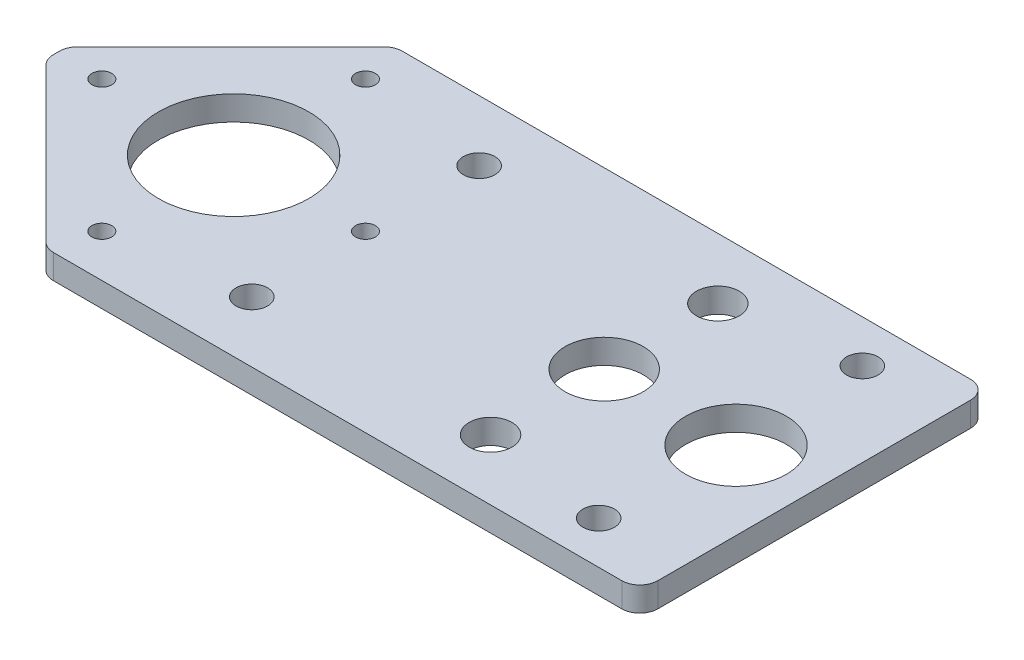
ISO-10303-21;
HEADER;
FILE_DESCRIPTION(('STEP AP214'),'2;1');
FILE_NAME('part.step','',(''),(''),'','','');
FILE_SCHEMA(('AUTOMOTIVE_DESIGN { 1 0 10303 214 1 1 1 1 }'));
ENDSEC;
DATA;
#1=APPLICATION_CONTEXT('core data for automotive mechanical design processes');
#2=APPLICATION_PROTOCOL_DEFINITION('international standard','automotive_design',2000,#1);
#3=PRODUCT_CONTEXT('',#1,'mechanical');
#4=PRODUCT('Part','Part','',(#3));
#5=PRODUCT_RELATED_PRODUCT_CATEGORY('part','',(#4));
#6=PRODUCT_DEFINITION_FORMATION('','',#4);
#7=PRODUCT_DEFINITION_CONTEXT('part definition',#1,'design');
#8=PRODUCT_DEFINITION('design','',#6,#7);
#9=PRODUCT_DEFINITION_SHAPE('','',#8);
#10=(LENGTH_UNIT() NAMED_UNIT(*) SI_UNIT(.MILLI.,.METRE.));
#11=(NAMED_UNIT(*) PLANE_ANGLE_UNIT() SI_UNIT($,.RADIAN.));
#12=(NAMED_UNIT(*) SI_UNIT($,.STERADIAN.) SOLID_ANGLE_UNIT());
#13=UNCERTAINTY_MEASURE_WITH_UNIT(LENGTH_MEASURE(1.E-05),#10,'distance_accuracy_value','');
#14=(GEOMETRIC_REPRESENTATION_CONTEXT(3) GLOBAL_UNCERTAINTY_ASSIGNED_CONTEXT((#13)) GLOBAL_UNIT_ASSIGNED_CONTEXT((#10,
#11,#12)) REPRESENTATION_CONTEXT('',''));
#15=CARTESIAN_POINT('',(0.,0.,0.));
#16=DIRECTION('',(0.,0.,1.));
#17=DIRECTION('',(1.,0.,0.));
#18=AXIS2_PLACEMENT_3D('',#15,#16,#17);
#19=CARTESIAN_POINT('',(-3.,4.064,-26.));
#20=DIRECTION('',(0.,-1.,0.));
#21=DIRECTION('',(0.,0.,-1.));
#22=AXIS2_PLACEMENT_3D('',#19,#20,#21);
#23=CYLINDRICAL_SURFACE('',#22,3.);
#24=CARTESIAN_POINT('',(-3.,0.,-26.));
#25=DIRECTION('',(0.,-1.,0.));
#26=DIRECTION('',(0.,0.,-1.));
#27=AXIS2_PLACEMENT_3D('',#24,#25,#26);
#28=CIRCLE('',#27,3.);
#29=CARTESIAN_POINT('',(-3.,0.,-29.));
#30=VERTEX_POINT('',#29);
#31=CARTESIAN_POINT('',(0.,0.,-26.));
#32=VERTEX_POINT('',#31);
#33=EDGE_CURVE('E163',#30,#32,#28,.T.);
#34=ORIENTED_EDGE('',*,*,#33,.F.);
#35=DIRECTION('',(0.,-1.,0.));
#36=VECTOR('',#35,1.);
#37=CARTESIAN_POINT('',(-3.,4.064,-29.));
#38=LINE('',#37,#36);
#39=CARTESIAN_POINT('',(-3.,4.064,-29.));
#40=VERTEX_POINT('',#39);
#41=EDGE_CURVE('E13',#40,#30,#38,.T.);
#42=ORIENTED_EDGE('',*,*,#41,.F.);
#43=CARTESIAN_POINT('',(-3.,4.064,-26.));
#44=DIRECTION('',(0.,-1.,0.));
#45=DIRECTION('',(0.,0.,-1.));
#46=AXIS2_PLACEMENT_3D('',#43,#44,#45);
#47=CIRCLE('',#46,3.);
#48=CARTESIAN_POINT('',(0.,4.064,-26.));
#49=VERTEX_POINT('',#48);
#50=EDGE_CURVE('E196',#40,#49,#47,.T.);
#51=ORIENTED_EDGE('',*,*,#50,.T.);
#52=DIRECTION('',(0.,-1.,0.));
#53=VECTOR('',#52,1.);
#54=CARTESIAN_POINT('',(0.,4.064,-26.));
#55=LINE('',#54,#53);
#56=EDGE_CURVE('E45',#49,#32,#55,.T.);
#57=ORIENTED_EDGE('',*,*,#56,.T.);
#58=EDGE_LOOP('',(#34,#42,#51,#57));
#59=FACE_BOUND('',#58,.T.);
#60=ADVANCED_FACE('F42',(#59),#23,.T.);
#61=CARTESIAN_POINT('',(-97.5,4.064,-29.));
#62=DIRECTION('',(0.,0.,-1.));
#63=DIRECTION('',(-1.,0.,0.));
#64=AXIS2_PLACEMENT_3D('',#61,#62,#63);
#65=PLANE('',#64);
#66=DIRECTION('',(1.,0.,0.));
#67=VECTOR('',#66,1.);
#68=CARTESIAN_POINT('',(-97.5,0.,-29.));
#69=LINE('',#68,#67);
#70=CARTESIAN_POINT('',(-97.5,0.,-29.));
#71=VERTEX_POINT('',#70);
#72=EDGE_CURVE('E194',#71,#30,#69,.T.);
#73=ORIENTED_EDGE('',*,*,#72,.F.);
#74=DIRECTION('',(0.,-1.,0.));
#75=VECTOR('',#74,1.);
#76=CARTESIAN_POINT('',(-97.5,4.064,-29.));
#77=LINE('',#76,#75);
#78=CARTESIAN_POINT('',(-97.5,4.064,-29.));
#79=VERTEX_POINT('',#78);
#80=EDGE_CURVE('E51',#79,#71,#77,.T.);
#81=ORIENTED_EDGE('',*,*,#80,.F.);
#82=DIRECTION('',(1.,0.,0.));
#83=VECTOR('',#82,1.);
#84=CARTESIAN_POINT('',(-97.5,4.064,-29.));
#85=LINE('',#84,#83);
#86=EDGE_CURVE('E153',#79,#40,#85,.T.);
#87=ORIENTED_EDGE('',*,*,#86,.T.);
#88=ORIENTED_EDGE('',*,*,#41,.T.);
#89=EDGE_LOOP('',(#73,#81,#87,#88));
#90=FACE_BOUND('',#89,.T.);
#91=ADVANCED_FACE('F216',(#90),#65,.T.);
#92=CARTESIAN_POINT('',(-97.5,4.064,-25.9999999999998));
#93=DIRECTION('',(0.,-1.,0.));
#94=DIRECTION('',(0.,0.,-1.));
#95=AXIS2_PLACEMENT_3D('',#92,#93,#94);
#96=CYLINDRICAL_SURFACE('',#95,3.00000000000019);
#97=CARTESIAN_POINT('',(-97.5,0.,-25.9999999999998));
#98=DIRECTION('',(0.,-1.,0.));
#99=DIRECTION('',(0.,0.,-1.));
#100=AXIS2_PLACEMENT_3D('',#97,#98,#99);
#101=CIRCLE('',#100,3.00000000000019);
#102=CARTESIAN_POINT('',(-99.6213203435598,0.,-28.1213203435596));
#103=VERTEX_POINT('',#102);
#104=EDGE_CURVE('E140',#103,#71,#101,.T.);
#105=ORIENTED_EDGE('',*,*,#104,.F.);
#106=DIRECTION('',(0.,-1.,0.));
#107=VECTOR('',#106,1.);
#108=CARTESIAN_POINT('',(-99.6213203435598,4.064,-28.1213203435596));
#109=LINE('',#108,#107);
#110=CARTESIAN_POINT('',(-99.6213203435598,4.064,-28.1213203435596));
#111=VERTEX_POINT('',#110);
#112=EDGE_CURVE('E135',#111,#103,#109,.T.);
#113=ORIENTED_EDGE('',*,*,#112,.F.);
#114=CARTESIAN_POINT('',(-97.5,4.064,-25.9999999999998));
#115=DIRECTION('',(0.,-1.,0.));
#116=DIRECTION('',(0.,0.,-1.));
#117=AXIS2_PLACEMENT_3D('',#114,#115,#116);
#118=CIRCLE('',#117,3.00000000000019);
#119=EDGE_CURVE('E138',#111,#79,#118,.T.);
#120=ORIENTED_EDGE('',*,*,#119,.T.);
#121=ORIENTED_EDGE('',*,*,#80,.T.);
#122=EDGE_LOOP('',(#105,#113,#120,#121));
#123=FACE_BOUND('',#122,.T.);
#124=ADVANCED_FACE('F137',(#123),#96,.T.);
#125=CARTESIAN_POINT('',(-125.12132034356,4.064,-2.62132034355977));
#126=DIRECTION('',(-0.707106781186547,0.,-0.707106781186548));
#127=DIRECTION('',(-0.707106781186548,0.,0.707106781186547));
#128=AXIS2_PLACEMENT_3D('',#125,#126,#127);
#129=PLANE('',#128);
#130=DIRECTION('',(0.707106781186548,0.,-0.707106781186547));
#131=VECTOR('',#130,1.);
#132=CARTESIAN_POINT('',(-125.12132034356,0.,-2.62132034355977));
#133=LINE('',#132,#131);
#134=CARTESIAN_POINT('',(-125.12132034356,0.,-2.62132034355977));
#135=VERTEX_POINT('',#134);
#136=EDGE_CURVE('E191',#135,#103,#133,.T.);
#137=ORIENTED_EDGE('',*,*,#136,.F.);
#138=DIRECTION('',(0.,-1.,0.));
#139=VECTOR('',#138,1.);
#140=CARTESIAN_POINT('',(-125.12132034356,4.064,-2.62132034355977));
#141=LINE('',#140,#139);
#142=CARTESIAN_POINT('',(-125.12132034356,4.064,-2.62132034355977));
#143=VERTEX_POINT('',#142);
#144=EDGE_CURVE('E145',#143,#135,#141,.T.);
#145=ORIENTED_EDGE('',*,*,#144,.F.);
#146=DIRECTION('',(0.707106781186548,0.,-0.707106781186547));
#147=VECTOR('',#146,1.);
#148=CARTESIAN_POINT('',(-125.12132034356,4.064,-2.62132034355977));
#149=LINE('',#148,#147);
#150=EDGE_CURVE('E151',#143,#111,#149,.T.);
#151=ORIENTED_EDGE('',*,*,#150,.T.);
#152=ORIENTED_EDGE('',*,*,#112,.T.);
#153=EDGE_LOOP('',(#137,#145,#151,#152));
#154=FACE_BOUND('',#153,.T.);
#155=ADVANCED_FACE('F155',(#154),#129,.T.);
#156=CARTESIAN_POINT('',(-123.,4.064,-0.5));
#157=DIRECTION('',(0.,-1.,0.));
#158=DIRECTION('',(0.,0.,-1.));
#159=AXIS2_PLACEMENT_3D('',#156,#157,#158);
#160=CYLINDRICAL_SURFACE('',#159,3.0000000000002);
#161=CARTESIAN_POINT('',(-123.,0.,-0.5));
#162=DIRECTION('',(0.,-1.,0.));
#163=DIRECTION('',(0.,0.,-1.));
#164=AXIS2_PLACEMENT_3D('',#161,#162,#163);
#165=CIRCLE('',#164,3.0000000000002);
#166=CARTESIAN_POINT('',(-126.,0.,-0.5));
#167=VERTEX_POINT('',#166);
#168=EDGE_CURVE('E188',#167,#135,#165,.T.);
#169=ORIENTED_EDGE('',*,*,#168,.F.);
#170=DIRECTION('',(0.,-1.,0.));
#171=VECTOR('',#170,1.);
#172=CARTESIAN_POINT('',(-126.,4.064,-0.5));
#173=LINE('',#172,#171);
#174=CARTESIAN_POINT('',(-126.,4.064,-0.5));
#175=VERTEX_POINT('',#174);
#176=EDGE_CURVE('E200',#175,#167,#173,.T.);
#177=ORIENTED_EDGE('',*,*,#176,.F.);
#178=CARTESIAN_POINT('',(-123.,4.064,-0.5));
#179=DIRECTION('',(0.,-1.,0.));
#180=DIRECTION('',(0.,0.,-1.));
#181=AXIS2_PLACEMENT_3D('',#178,#179,#180);
#182=CIRCLE('',#181,3.0000000000002);
#183=EDGE_CURVE('E156',#175,#143,#182,.T.);
#184=ORIENTED_EDGE('',*,*,#183,.T.);
#185=ORIENTED_EDGE('',*,*,#144,.T.);
#186=EDGE_LOOP('',(#169,#177,#184,#185));
#187=FACE_BOUND('',#186,.T.);
#188=ADVANCED_FACE('F229',(#187),#160,.T.);
#189=CARTESIAN_POINT('',(-126.,4.064,0.500000000000084));
#190=DIRECTION('',(-1.,0.,0.));
#191=DIRECTION('',(0.,0.,1.));
#192=AXIS2_PLACEMENT_3D('',#189,#190,#191);
#193=PLANE('',#192);
#194=DIRECTION('',(0.,0.,-1.));
#195=VECTOR('',#194,1.);
#196=CARTESIAN_POINT('',(-126.,0.,0.500000000000084));
#197=LINE('',#196,#195);
#198=CARTESIAN_POINT('',(-126.,0.,0.500000000000084));
#199=VERTEX_POINT('',#198);
#200=EDGE_CURVE('E185',#199,#167,#197,.T.);
#201=ORIENTED_EDGE('',*,*,#200,.F.);
#202=DIRECTION('',(0.,-1.,0.));
#203=VECTOR('',#202,1.);
#204=CARTESIAN_POINT('',(-126.,4.064,0.500000000000084));
#205=LINE('',#204,#203);
#206=CARTESIAN_POINT('',(-126.,4.064,0.500000000000084));
#207=VERTEX_POINT('',#206);
#208=EDGE_CURVE('E202',#207,#199,#205,.T.);
#209=ORIENTED_EDGE('',*,*,#208,.F.);
#210=DIRECTION('',(0.,0.,-1.));
#211=VECTOR('',#210,1.);
#212=CARTESIAN_POINT('',(-126.,4.064,0.500000000000084));
#213=LINE('',#212,#211);
#214=EDGE_CURVE('E158',#207,#175,#213,.T.);
#215=ORIENTED_EDGE('',*,*,#214,.T.);
#216=ORIENTED_EDGE('',*,*,#176,.T.);
#217=EDGE_LOOP('',(#201,#209,#215,#216));
#218=FACE_BOUND('',#217,.T.);
#219=ADVANCED_FACE('F232',(#218),#193,.T.);
#220=CARTESIAN_POINT('',(-123.,4.064,0.500000000000084));
#221=DIRECTION('',(0.,-1.,0.));
#222=DIRECTION('',(0.,0.,-1.));
#223=AXIS2_PLACEMENT_3D('',#220,#221,#222);
#224=CYLINDRICAL_SURFACE('',#223,3.00000000000018);
#225=CARTESIAN_POINT('',(-123.,0.,0.500000000000084));
#226=DIRECTION('',(0.,-1.,0.));
#227=DIRECTION('',(0.,0.,-1.));
#228=AXIS2_PLACEMENT_3D('',#225,#226,#227);
#229=CIRCLE('',#228,3.00000000000018);
#230=CARTESIAN_POINT('',(-125.12132034356,0.,2.62132034355986));
#231=VERTEX_POINT('',#230);
#232=EDGE_CURVE('E182',#231,#199,#229,.T.);
#233=ORIENTED_EDGE('',*,*,#232,.F.);
#234=DIRECTION('',(0.,-1.,0.));
#235=VECTOR('',#234,1.);
#236=CARTESIAN_POINT('',(-125.12132034356,4.064,2.62132034355986));
#237=LINE('',#236,#235);
#238=CARTESIAN_POINT('',(-125.12132034356,4.064,2.62132034355986));
#239=VERTEX_POINT('',#238);
#240=EDGE_CURVE('E204',#239,#231,#237,.T.);
#241=ORIENTED_EDGE('',*,*,#240,.F.);
#242=CARTESIAN_POINT('',(-123.,4.064,0.500000000000084));
#243=DIRECTION('',(0.,-1.,0.));
#244=DIRECTION('',(0.,0.,-1.));
#245=AXIS2_PLACEMENT_3D('',#242,#243,#244);
#246=CIRCLE('',#245,3.00000000000018);
#247=EDGE_CURVE('E416',#239,#207,#246,.T.);
#248=ORIENTED_EDGE('',*,*,#247,.T.);
#249=ORIENTED_EDGE('',*,*,#208,.T.);
#250=EDGE_LOOP('',(#233,#241,#248,#249));
#251=FACE_BOUND('',#250,.T.);
#252=ADVANCED_FACE('F236',(#251),#224,.T.);
#253=CARTESIAN_POINT('',(-99.6213203435598,4.064,28.1213203435596));
#254=DIRECTION('',(-0.707106781186546,0.,0.707106781186549));
#255=DIRECTION('',(0.707106781186549,0.,0.707106781186546));
#256=AXIS2_PLACEMENT_3D('',#253,#254,#255);
#257=PLANE('',#256);
#258=DIRECTION('',(-0.707106781186549,0.,-0.707106781186546));
#259=VECTOR('',#258,1.);
#260=CARTESIAN_POINT('',(-99.6213203435598,0.,28.1213203435596));
#261=LINE('',#260,#259);
#262=CARTESIAN_POINT('',(-99.6213203435598,0.,28.1213203435596));
#263=VERTEX_POINT('',#262);
#264=EDGE_CURVE('E179',#263,#231,#261,.T.);
#265=ORIENTED_EDGE('',*,*,#264,.F.);
#266=DIRECTION('',(0.,-1.,0.));
#267=VECTOR('',#266,1.);
#268=CARTESIAN_POINT('',(-99.6213203435598,4.064,28.1213203435596));
#269=LINE('',#268,#267);
#270=CARTESIAN_POINT('',(-99.6213203435598,4.064,28.1213203435596));
#271=VERTEX_POINT('',#270);
#272=EDGE_CURVE('E206',#271,#263,#269,.T.);
#273=ORIENTED_EDGE('',*,*,#272,.F.);
#274=DIRECTION('',(-0.707106781186549,0.,-0.707106781186546));
#275=VECTOR('',#274,1.);
#276=CARTESIAN_POINT('',(-99.6213203435598,4.064,28.1213203435596));
#277=LINE('',#276,#275);
#278=EDGE_CURVE('E413',#271,#239,#277,.T.);
#279=ORIENTED_EDGE('',*,*,#278,.T.);
#280=ORIENTED_EDGE('',*,*,#240,.T.);
#281=EDGE_LOOP('',(#265,#273,#279,#280));
#282=FACE_BOUND('',#281,.T.);
#283=ADVANCED_FACE('F240',(#282),#257,.T.);
#284=CARTESIAN_POINT('',(-97.5,4.064,25.9999999999998));
#285=DIRECTION('',(0.,-1.,0.));
#286=DIRECTION('',(0.,0.,-1.));
#287=AXIS2_PLACEMENT_3D('',#284,#285,#286);
#288=CYLINDRICAL_SURFACE('',#287,3.00000000000019);
#289=CARTESIAN_POINT('',(-97.5,0.,25.9999999999998));
#290=DIRECTION('',(0.,-1.,0.));
#291=DIRECTION('',(0.,0.,-1.));
#292=AXIS2_PLACEMENT_3D('',#289,#290,#291);
#293=CIRCLE('',#292,3.00000000000019);
#294=CARTESIAN_POINT('',(-97.5,0.,29.));
#295=VERTEX_POINT('',#294);
#296=EDGE_CURVE('E176',#295,#263,#293,.T.);
#297=ORIENTED_EDGE('',*,*,#296,.F.);
#298=DIRECTION('',(0.,-1.,0.));
#299=VECTOR('',#298,1.);
#300=CARTESIAN_POINT('',(-97.5,4.064,29.));
#301=LINE('',#300,#299);
#302=CARTESIAN_POINT('',(-97.5,4.064,29.));
#303=VERTEX_POINT('',#302);
#304=EDGE_CURVE('E208',#303,#295,#301,.T.);
#305=ORIENTED_EDGE('',*,*,#304,.F.);
#306=CARTESIAN_POINT('',(-97.5,4.064,25.9999999999998));
#307=DIRECTION('',(0.,-1.,0.));
#308=DIRECTION('',(0.,0.,-1.));
#309=AXIS2_PLACEMENT_3D('',#306,#307,#308);
#310=CIRCLE('',#309,3.00000000000019);
#311=EDGE_CURVE('E410',#303,#271,#310,.T.);
#312=ORIENTED_EDGE('',*,*,#311,.T.);
#313=ORIENTED_EDGE('',*,*,#272,.T.);
#314=EDGE_LOOP('',(#297,#305,#312,#313));
#315=FACE_BOUND('',#314,.T.);
#316=ADVANCED_FACE('F244',(#315),#288,.T.);
#317=CARTESIAN_POINT('',(-3.,4.064,29.));
#318=DIRECTION('',(0.,0.,1.));
#319=DIRECTION('',(1.,0.,0.));
#320=AXIS2_PLACEMENT_3D('',#317,#318,#319);
#321=PLANE('',#320);
#322=DIRECTION('',(-1.,0.,0.));
#323=VECTOR('',#322,1.);
#324=CARTESIAN_POINT('',(-3.,0.,29.));
#325=LINE('',#324,#323);
#326=CARTESIAN_POINT('',(-3.,0.,29.));
#327=VERTEX_POINT('',#326);
#328=EDGE_CURVE('E173',#327,#295,#325,.T.);
#329=ORIENTED_EDGE('',*,*,#328,.F.);
#330=DIRECTION('',(0.,-1.,0.));
#331=VECTOR('',#330,1.);
#332=CARTESIAN_POINT('',(-3.,4.064,29.));
#333=LINE('',#332,#331);
#334=CARTESIAN_POINT('',(-3.,4.064,29.));
#335=VERTEX_POINT('',#334);
#336=EDGE_CURVE('E210',#335,#327,#333,.T.);
#337=ORIENTED_EDGE('',*,*,#336,.F.);
#338=DIRECTION('',(-1.,0.,0.));
#339=VECTOR('',#338,1.);
#340=CARTESIAN_POINT('',(-3.,4.064,29.));
#341=LINE('',#340,#339);
#342=EDGE_CURVE('E407',#335,#303,#341,.T.);
#343=ORIENTED_EDGE('',*,*,#342,.T.);
#344=ORIENTED_EDGE('',*,*,#304,.T.);
#345=EDGE_LOOP('',(#329,#337,#343,#344));
#346=FACE_BOUND('',#345,.T.);
#347=ADVANCED_FACE('F248',(#346),#321,.T.);
#348=CARTESIAN_POINT('',(-3.,4.064,26.));
#349=DIRECTION('',(0.,-1.,0.));
#350=DIRECTION('',(0.,0.,-1.));
#351=AXIS2_PLACEMENT_3D('',#348,#349,#350);
#352=CYLINDRICAL_SURFACE('',#351,3.);
#353=CARTESIAN_POINT('',(-3.,0.,26.));
#354=DIRECTION('',(0.,-1.,0.));
#355=DIRECTION('',(0.,0.,-1.));
#356=AXIS2_PLACEMENT_3D('',#353,#354,#355);
#357=CIRCLE('',#356,3.);
#358=CARTESIAN_POINT('',(0.,0.,26.));
#359=VERTEX_POINT('',#358);
#360=EDGE_CURVE('E170',#359,#327,#357,.T.);
#361=ORIENTED_EDGE('',*,*,#360,.F.);
#362=DIRECTION('',(0.,-1.,0.));
#363=VECTOR('',#362,1.);
#364=CARTESIAN_POINT('',(0.,4.064,26.));
#365=LINE('',#364,#363);
#366=CARTESIAN_POINT('',(0.,4.064,26.));
#367=VERTEX_POINT('',#366);
#368=EDGE_CURVE('E211',#367,#359,#365,.T.);
#369=ORIENTED_EDGE('',*,*,#368,.F.);
#370=CARTESIAN_POINT('',(-3.,4.064,26.));
#371=DIRECTION('',(0.,-1.,0.));
#372=DIRECTION('',(0.,0.,-1.));
#373=AXIS2_PLACEMENT_3D('',#370,#371,#372);
#374=CIRCLE('',#373,3.);
#375=EDGE_CURVE('E404',#367,#335,#374,.T.);
#376=ORIENTED_EDGE('',*,*,#375,.T.);
#377=ORIENTED_EDGE('',*,*,#336,.T.);
#378=EDGE_LOOP('',(#361,#369,#376,#377));
#379=FACE_BOUND('',#378,.T.);
#380=ADVANCED_FACE('F252',(#379),#352,.T.);
#381=CARTESIAN_POINT('',(0.,4.064,-26.));
#382=DIRECTION('',(1.,0.,0.));
#383=DIRECTION('',(0.,0.,-1.));
#384=AXIS2_PLACEMENT_3D('',#381,#382,#383);
#385=PLANE('',#384);
#386=DIRECTION('',(0.,0.,1.));
#387=VECTOR('',#386,1.);
#388=CARTESIAN_POINT('',(0.,0.,-26.));
#389=LINE('',#388,#387);
#390=EDGE_CURVE('E166',#32,#359,#389,.T.);
#391=ORIENTED_EDGE('',*,*,#390,.F.);
#392=ORIENTED_EDGE('',*,*,#56,.F.);
#393=DIRECTION('',(0.,0.,1.));
#394=VECTOR('',#393,1.);
#395=CARTESIAN_POINT('',(0.,4.064,-26.));
#396=LINE('',#395,#394);
#397=EDGE_CURVE('E402',#49,#367,#396,.T.);
#398=ORIENTED_EDGE('',*,*,#397,.T.);
#399=ORIENTED_EDGE('',*,*,#368,.T.);
#400=EDGE_LOOP('',(#391,#392,#398,#399));
#401=FACE_BOUND('',#400,.T.);
#402=ADVANCED_FACE('F213',(#401),#385,.T.);
#403=CARTESIAN_POINT('',(-3.,4.064,-26.));
#404=DIRECTION('',(0.,-1.,0.));
#405=DIRECTION('',(0.,0.,-1.));
#406=AXIS2_PLACEMENT_3D('',#403,#404,#405);
#407=PLANE('',#406);
#408=CARTESIAN_POINT('',(-34.92008573971,4.064,0.));
#409=DIRECTION('',(0.,-1.,0.));
#410=DIRECTION('',(0.,0.,1.));
#411=AXIS2_PLACEMENT_3D('',#408,#409,#410);
#412=CIRCLE('',#411,6.5);
#413=CARTESIAN_POINT('',(-34.92008573971,4.064,6.50000000000001));
#414=VERTEX_POINT('',#413);
#415=EDGE_CURVE('E323',#414,#414,#412,.T.);
#416=ORIENTED_EDGE('',*,*,#415,.T.);
#417=EDGE_LOOP('',(#416));
#418=FACE_BOUND('',#417,.T.);
#419=CARTESIAN_POINT('',(-13.92008573971,4.064,-21.920310216783));
#420=DIRECTION('',(0.,-1.,0.));
#421=DIRECTION('',(0.,0.,1.));
#422=AXIS2_PLACEMENT_3D('',#419,#420,#421);
#423=CIRCLE('',#422,2.625);
#424=CARTESIAN_POINT('',(-13.92008573971,4.064,-19.295310216783));
#425=VERTEX_POINT('',#424);
#426=EDGE_CURVE('E331',#425,#425,#423,.T.);
#427=ORIENTED_EDGE('',*,*,#426,.T.);
#428=EDGE_LOOP('',(#427));
#429=FACE_BOUND('',#428,.T.);
#430=CARTESIAN_POINT('',(-13.92008573971,4.064,21.920310216783));
#431=DIRECTION('',(0.,-1.,0.));
#432=DIRECTION('',(0.,0.,1.));
#433=AXIS2_PLACEMENT_3D('',#430,#431,#432);
#434=CIRCLE('',#433,2.62500000000002);
#435=CARTESIAN_POINT('',(-13.92008573971,4.064,24.545310216783));
#436=VERTEX_POINT('',#435);
#437=EDGE_CURVE('E337',#436,#436,#434,.T.);
#438=ORIENTED_EDGE('',*,*,#437,.T.);
#439=EDGE_LOOP('',(#438));
#440=FACE_BOUND('',#439,.T.);
#441=CARTESIAN_POINT('',(-96.540395956493,4.064,21.920310216783));
#442=DIRECTION('',(0.,-1.,0.));
#443=DIRECTION('',(0.,0.,1.));
#444=AXIS2_PLACEMENT_3D('',#441,#442,#443);
#445=CIRCLE('',#444,1.65);
#446=CARTESIAN_POINT('',(-96.540395956493,4.064,23.570310216783));
#447=VERTEX_POINT('',#446);
#448=EDGE_CURVE('E343',#447,#447,#445,.T.);
#449=ORIENTED_EDGE('',*,*,#448,.T.);
#450=EDGE_LOOP('',(#449));
#451=FACE_BOUND('',#450,.T.);
#452=CARTESIAN_POINT('',(-96.540395956493,4.064,-21.920310216783));
#453=DIRECTION('',(0.,-1.,0.));
#454=DIRECTION('',(0.,0.,1.));
#455=AXIS2_PLACEMENT_3D('',#452,#453,#454);
#456=CIRCLE('',#455,1.65);
#457=CARTESIAN_POINT('',(-96.540395956493,4.064,-20.270310216783));
#458=VERTEX_POINT('',#457);
#459=EDGE_CURVE('E349',#458,#458,#456,.T.);
#460=ORIENTED_EDGE('',*,*,#459,.T.);
#461=EDGE_LOOP('',(#460));
#462=FACE_BOUND('',#461,.T.);
#463=CARTESIAN_POINT('',(-118.460706173276,4.064,0.));
#464=DIRECTION('',(0.,-1.,0.));
#465=DIRECTION('',(0.,0.,1.));
#466=AXIS2_PLACEMENT_3D('',#463,#464,#465);
#467=CIRCLE('',#466,1.65);
#468=CARTESIAN_POINT('',(-118.460706173276,4.064,1.65000000000002));
#469=VERTEX_POINT('',#468);
#470=EDGE_CURVE('E355',#469,#469,#467,.T.);
#471=ORIENTED_EDGE('',*,*,#470,.T.);
#472=EDGE_LOOP('',(#471));
#473=FACE_BOUND('',#472,.T.);
#474=CARTESIAN_POINT('',(-74.62008573971,4.064,0.));
#475=DIRECTION('',(0.,-1.,0.));
#476=DIRECTION('',(0.,0.,1.));
#477=AXIS2_PLACEMENT_3D('',#474,#475,#476);
#478=CIRCLE('',#477,1.65);
#479=CARTESIAN_POINT('',(-74.62008573971,4.064,1.65000000000002));
#480=VERTEX_POINT('',#479);
#481=EDGE_CURVE('E361',#480,#480,#478,.T.);
#482=ORIENTED_EDGE('',*,*,#481,.T.);
#483=EDGE_LOOP('',(#482));
#484=FACE_BOUND('',#483,.T.);
#485=CARTESIAN_POINT('',(-96.540395956493,4.064,0.));
#486=DIRECTION('',(0.,-1.,0.));
#487=DIRECTION('',(0.,0.,1.));
#488=AXIS2_PLACEMENT_3D('',#485,#486,#487);
#489=CIRCLE('',#488,12.5);
#490=CARTESIAN_POINT('',(-96.540395956493,4.064,12.5));
#491=VERTEX_POINT('',#490);
#492=EDGE_CURVE('E367',#491,#491,#489,.T.);
#493=ORIENTED_EDGE('',*,*,#492,.T.);
#494=EDGE_LOOP('',(#493));
#495=FACE_BOUND('',#494,.T.);
#496=CARTESIAN_POINT('',(-74.62008573971,4.064,-18.9));
#497=DIRECTION('',(0.,-1.,0.));
#498=DIRECTION('',(0.,0.,1.));
#499=AXIS2_PLACEMENT_3D('',#496,#497,#498);
#500=CIRCLE('',#499,2.625);
#501=CARTESIAN_POINT('',(-74.62008573971,4.064,-16.275));
#502=VERTEX_POINT('',#501);
#503=EDGE_CURVE('E373',#502,#502,#500,.T.);
#504=ORIENTED_EDGE('',*,*,#503,.T.);
#505=EDGE_LOOP('',(#504));
#506=FACE_BOUND('',#505,.T.);
#507=CARTESIAN_POINT('',(-34.92008573971,4.064,-18.9));
#508=DIRECTION('',(0.,-1.,0.));
#509=DIRECTION('',(0.,0.,1.));
#510=AXIS2_PLACEMENT_3D('',#507,#508,#509);
#511=CIRCLE('',#510,3.56);
#512=CARTESIAN_POINT('',(-34.92008573971,4.064,-15.34));
#513=VERTEX_POINT('',#512);
#514=EDGE_CURVE('E379',#513,#513,#511,.T.);
#515=ORIENTED_EDGE('',*,*,#514,.T.);
#516=EDGE_LOOP('',(#515));
#517=FACE_BOUND('',#516,.T.);
#518=CARTESIAN_POINT('',(-74.62008573971,4.064,18.9));
#519=DIRECTION('',(0.,-1.,0.));
#520=DIRECTION('',(0.,0.,1.));
#521=AXIS2_PLACEMENT_3D('',#518,#519,#520);
#522=CIRCLE('',#521,2.62500000000002);
#523=CARTESIAN_POINT('',(-74.62008573971,4.064,21.525));
#524=VERTEX_POINT('',#523);
#525=EDGE_CURVE('E385',#524,#524,#522,.T.);
#526=ORIENTED_EDGE('',*,*,#525,.T.);
#527=EDGE_LOOP('',(#526));
#528=FACE_BOUND('',#527,.T.);
#529=CARTESIAN_POINT('',(-34.92008573971,4.064,18.9));
#530=DIRECTION('',(0.,-1.,0.));
#531=DIRECTION('',(0.,0.,1.));
#532=AXIS2_PLACEMENT_3D('',#529,#530,#531);
#533=CIRCLE('',#532,3.56);
#534=CARTESIAN_POINT('',(-34.92008573971,4.064,22.46));
#535=VERTEX_POINT('',#534);
#536=EDGE_CURVE('E391',#535,#535,#533,.T.);
#537=ORIENTED_EDGE('',*,*,#536,.T.);
#538=EDGE_LOOP('',(#537));
#539=FACE_BOUND('',#538,.T.);
#540=CARTESIAN_POINT('',(-13.,4.064,0.));
#541=DIRECTION('',(0.,-1.,0.));
#542=DIRECTION('',(0.,0.,1.));
#543=AXIS2_PLACEMENT_3D('',#540,#541,#542);
#544=CIRCLE('',#543,8.37500000000002);
#545=CARTESIAN_POINT('',(-13.,4.064,8.37500000000003));
#546=VERTEX_POINT('',#545);
#547=EDGE_CURVE('E167',#546,#546,#544,.T.);
#548=ORIENTED_EDGE('',*,*,#547,.T.);
#549=EDGE_LOOP('',(#548));
#550=FACE_BOUND('',#549,.T.);
#551=ORIENTED_EDGE('',*,*,#50,.F.);
#552=ORIENTED_EDGE('',*,*,#86,.F.);
#553=ORIENTED_EDGE('',*,*,#119,.F.);
#554=ORIENTED_EDGE('',*,*,#150,.F.);
#555=ORIENTED_EDGE('',*,*,#183,.F.);
#556=ORIENTED_EDGE('',*,*,#214,.F.);
#557=ORIENTED_EDGE('',*,*,#247,.F.);
#558=ORIENTED_EDGE('',*,*,#278,.F.);
#559=ORIENTED_EDGE('',*,*,#311,.F.);
#560=ORIENTED_EDGE('',*,*,#342,.F.);
#561=ORIENTED_EDGE('',*,*,#375,.F.);
#562=ORIENTED_EDGE('',*,*,#397,.F.);
#563=EDGE_LOOP('',(#551,#552,#553,#554,#555,#556,#557,#558,#559,#560,#561,#562));
#564=FACE_BOUND('',#563,.T.);
#565=ADVANCED_FACE('F149',(#418,#429,#440,#451,#462,#473,#484,#495,#506,#517,#528,#539,#550,
#564),#407,.F.);
#566=CARTESIAN_POINT('',(-3.,0.,-26.));
#567=DIRECTION('',(0.,-1.,0.));
#568=DIRECTION('',(0.,0.,-1.));
#569=AXIS2_PLACEMENT_3D('',#566,#567,#568);
#570=PLANE('',#569);
#571=CARTESIAN_POINT('',(-34.92008573971,0.,0.));
#572=DIRECTION('',(0.,-1.,0.));
#573=DIRECTION('',(0.,0.,1.));
#574=AXIS2_PLACEMENT_3D('',#571,#572,#573);
#575=CIRCLE('',#574,6.5);
#576=CARTESIAN_POINT('',(-34.92008573971,0.,6.50000000000001));
#577=VERTEX_POINT('',#576);
#578=EDGE_CURVE('E326',#577,#577,#575,.T.);
#579=ORIENTED_EDGE('',*,*,#578,.F.);
#580=EDGE_LOOP('',(#579));
#581=FACE_BOUND('',#580,.T.);
#582=CARTESIAN_POINT('',(-13.92008573971,0.,-21.920310216783));
#583=DIRECTION('',(0.,-1.,0.));
#584=DIRECTION('',(0.,0.,1.));
#585=AXIS2_PLACEMENT_3D('',#582,#583,#584);
#586=CIRCLE('',#585,2.625);
#587=CARTESIAN_POINT('',(-13.92008573971,0.,-19.295310216783));
#588=VERTEX_POINT('',#587);
#589=EDGE_CURVE('E328',#588,#588,#586,.T.);
#590=ORIENTED_EDGE('',*,*,#589,.F.);
#591=EDGE_LOOP('',(#590));
#592=FACE_BOUND('',#591,.T.);
#593=CARTESIAN_POINT('',(-13.92008573971,0.,21.920310216783));
#594=DIRECTION('',(0.,-1.,0.));
#595=DIRECTION('',(0.,0.,1.));
#596=AXIS2_PLACEMENT_3D('',#593,#594,#595);
#597=CIRCLE('',#596,2.62500000000002);
#598=CARTESIAN_POINT('',(-13.92008573971,0.,24.545310216783));
#599=VERTEX_POINT('',#598);
#600=EDGE_CURVE('E334',#599,#599,#597,.T.);
#601=ORIENTED_EDGE('',*,*,#600,.F.);
#602=EDGE_LOOP('',(#601));
#603=FACE_BOUND('',#602,.T.);
#604=CARTESIAN_POINT('',(-96.540395956493,0.,21.920310216783));
#605=DIRECTION('',(0.,-1.,0.));
#606=DIRECTION('',(0.,0.,1.));
#607=AXIS2_PLACEMENT_3D('',#604,#605,#606);
#608=CIRCLE('',#607,1.65);
#609=CARTESIAN_POINT('',(-96.540395956493,0.,23.570310216783));
#610=VERTEX_POINT('',#609);
#611=EDGE_CURVE('E340',#610,#610,#608,.T.);
#612=ORIENTED_EDGE('',*,*,#611,.F.);
#613=EDGE_LOOP('',(#612));
#614=FACE_BOUND('',#613,.T.);
#615=CARTESIAN_POINT('',(-96.540395956493,0.,-21.920310216783));
#616=DIRECTION('',(0.,-1.,0.));
#617=DIRECTION('',(0.,0.,1.));
#618=AXIS2_PLACEMENT_3D('',#615,#616,#617);
#619=CIRCLE('',#618,1.65);
#620=CARTESIAN_POINT('',(-96.540395956493,0.,-20.270310216783));
#621=VERTEX_POINT('',#620);
#622=EDGE_CURVE('E346',#621,#621,#619,.T.);
#623=ORIENTED_EDGE('',*,*,#622,.F.);
#624=EDGE_LOOP('',(#623));
#625=FACE_BOUND('',#624,.T.);
#626=CARTESIAN_POINT('',(-118.460706173276,0.,0.));
#627=DIRECTION('',(0.,-1.,0.));
#628=DIRECTION('',(0.,0.,1.));
#629=AXIS2_PLACEMENT_3D('',#626,#627,#628);
#630=CIRCLE('',#629,1.65);
#631=CARTESIAN_POINT('',(-118.460706173276,0.,1.65000000000002));
#632=VERTEX_POINT('',#631);
#633=EDGE_CURVE('E352',#632,#632,#630,.T.);
#634=ORIENTED_EDGE('',*,*,#633,.F.);
#635=EDGE_LOOP('',(#634));
#636=FACE_BOUND('',#635,.T.);
#637=CARTESIAN_POINT('',(-74.62008573971,0.,0.));
#638=DIRECTION('',(0.,-1.,0.));
#639=DIRECTION('',(0.,0.,1.));
#640=AXIS2_PLACEMENT_3D('',#637,#638,#639);
#641=CIRCLE('',#640,1.65);
#642=CARTESIAN_POINT('',(-74.62008573971,0.,1.65000000000002));
#643=VERTEX_POINT('',#642);
#644=EDGE_CURVE('E358',#643,#643,#641,.T.);
#645=ORIENTED_EDGE('',*,*,#644,.F.);
#646=EDGE_LOOP('',(#645));
#647=FACE_BOUND('',#646,.T.);
#648=CARTESIAN_POINT('',(-96.540395956493,0.,0.));
#649=DIRECTION('',(0.,-1.,0.));
#650=DIRECTION('',(0.,0.,1.));
#651=AXIS2_PLACEMENT_3D('',#648,#649,#650);
#652=CIRCLE('',#651,12.5);
#653=CARTESIAN_POINT('',(-96.540395956493,0.,12.5));
#654=VERTEX_POINT('',#653);
#655=EDGE_CURVE('E364',#654,#654,#652,.T.);
#656=ORIENTED_EDGE('',*,*,#655,.F.);
#657=EDGE_LOOP('',(#656));
#658=FACE_BOUND('',#657,.T.);
#659=CARTESIAN_POINT('',(-74.62008573971,0.,-18.9));
#660=DIRECTION('',(0.,-1.,0.));
#661=DIRECTION('',(0.,0.,1.));
#662=AXIS2_PLACEMENT_3D('',#659,#660,#661);
#663=CIRCLE('',#662,2.625);
#664=CARTESIAN_POINT('',(-74.62008573971,0.,-16.275));
#665=VERTEX_POINT('',#664);
#666=EDGE_CURVE('E370',#665,#665,#663,.T.);
#667=ORIENTED_EDGE('',*,*,#666,.F.);
#668=EDGE_LOOP('',(#667));
#669=FACE_BOUND('',#668,.T.);
#670=CARTESIAN_POINT('',(-34.92008573971,0.,-18.9));
#671=DIRECTION('',(0.,-1.,0.));
#672=DIRECTION('',(0.,0.,1.));
#673=AXIS2_PLACEMENT_3D('',#670,#671,#672);
#674=CIRCLE('',#673,3.56);
#675=CARTESIAN_POINT('',(-34.92008573971,0.,-15.34));
#676=VERTEX_POINT('',#675);
#677=EDGE_CURVE('E376',#676,#676,#674,.T.);
#678=ORIENTED_EDGE('',*,*,#677,.F.);
#679=EDGE_LOOP('',(#678));
#680=FACE_BOUND('',#679,.T.);
#681=CARTESIAN_POINT('',(-74.62008573971,0.,18.9));
#682=DIRECTION('',(0.,-1.,0.));
#683=DIRECTION('',(0.,0.,1.));
#684=AXIS2_PLACEMENT_3D('',#681,#682,#683);
#685=CIRCLE('',#684,2.62500000000002);
#686=CARTESIAN_POINT('',(-74.62008573971,0.,21.525));
#687=VERTEX_POINT('',#686);
#688=EDGE_CURVE('E382',#687,#687,#685,.T.);
#689=ORIENTED_EDGE('',*,*,#688,.F.);
#690=EDGE_LOOP('',(#689));
#691=FACE_BOUND('',#690,.T.);
#692=CARTESIAN_POINT('',(-34.92008573971,0.,18.9));
#693=DIRECTION('',(0.,-1.,0.));
#694=DIRECTION('',(0.,0.,1.));
#695=AXIS2_PLACEMENT_3D('',#692,#693,#694);
#696=CIRCLE('',#695,3.56);
#697=CARTESIAN_POINT('',(-34.92008573971,0.,22.46));
#698=VERTEX_POINT('',#697);
#699=EDGE_CURVE('E388',#698,#698,#696,.T.);
#700=ORIENTED_EDGE('',*,*,#699,.F.);
#701=EDGE_LOOP('',(#700));
#702=FACE_BOUND('',#701,.T.);
#703=CARTESIAN_POINT('',(-13.,0.,0.));
#704=DIRECTION('',(0.,-1.,0.));
#705=DIRECTION('',(0.,0.,1.));
#706=AXIS2_PLACEMENT_3D('',#703,#704,#705);
#707=CIRCLE('',#706,8.37500000000002);
#708=CARTESIAN_POINT('',(-13.,0.,8.37500000000003));
#709=VERTEX_POINT('',#708);
#710=EDGE_CURVE('E394',#709,#709,#707,.T.);
#711=ORIENTED_EDGE('',*,*,#710,.F.);
#712=EDGE_LOOP('',(#711));
#713=FACE_BOUND('',#712,.T.);
#714=ORIENTED_EDGE('',*,*,#33,.T.);
#715=ORIENTED_EDGE('',*,*,#390,.T.);
#716=ORIENTED_EDGE('',*,*,#360,.T.);
#717=ORIENTED_EDGE('',*,*,#328,.T.);
#718=ORIENTED_EDGE('',*,*,#296,.T.);
#719=ORIENTED_EDGE('',*,*,#264,.T.);
#720=ORIENTED_EDGE('',*,*,#232,.T.);
#721=ORIENTED_EDGE('',*,*,#200,.T.);
#722=ORIENTED_EDGE('',*,*,#168,.T.);
#723=ORIENTED_EDGE('',*,*,#136,.T.);
#724=ORIENTED_EDGE('',*,*,#104,.T.);
#725=ORIENTED_EDGE('',*,*,#72,.T.);
#726=EDGE_LOOP('',(#714,#715,#716,#717,#718,#719,#720,#721,#722,#723,#724,#725));
#727=FACE_BOUND('',#726,.T.);
#728=ADVANCED_FACE('F215',(#581,#592,#603,#614,#625,#636,#647,#658,#669,#680,#691,#702,#713,
#727),#570,.T.);
#729=CARTESIAN_POINT('',(-13.,4.064,0.));
#730=DIRECTION('',(0.,-1.,0.));
#731=DIRECTION('',(0.,0.,-1.));
#732=AXIS2_PLACEMENT_3D('',#729,#730,#731);
#733=CYLINDRICAL_SURFACE('',#732,8.37500000000002);
#734=ORIENTED_EDGE('',*,*,#547,.F.);
#735=EDGE_LOOP('',(#734));
#736=FACE_BOUND('',#735,.T.);
#737=ORIENTED_EDGE('',*,*,#710,.T.);
#738=EDGE_LOOP('',(#737));
#739=FACE_BOUND('',#738,.T.);
#740=ADVANCED_FACE('F264',(#736,#739),#733,.F.);
#741=CARTESIAN_POINT('',(-34.92008573971,4.064,18.9));
#742=DIRECTION('',(0.,-1.,0.));
#743=DIRECTION('',(0.,0.,-1.));
#744=AXIS2_PLACEMENT_3D('',#741,#742,#743);
#745=CYLINDRICAL_SURFACE('',#744,3.56);
#746=ORIENTED_EDGE('',*,*,#536,.F.);
#747=EDGE_LOOP('',(#746));
#748=FACE_BOUND('',#747,.T.);
#749=ORIENTED_EDGE('',*,*,#699,.T.);
#750=EDGE_LOOP('',(#749));
#751=FACE_BOUND('',#750,.T.);
#752=ADVANCED_FACE('F271',(#748,#751),#745,.F.);
#753=CARTESIAN_POINT('',(-74.62008573971,4.064,18.9));
#754=DIRECTION('',(0.,-1.,0.));
#755=DIRECTION('',(0.,0.,-1.));
#756=AXIS2_PLACEMENT_3D('',#753,#754,#755);
#757=CYLINDRICAL_SURFACE('',#756,2.62500000000002);
#758=ORIENTED_EDGE('',*,*,#525,.F.);
#759=EDGE_LOOP('',(#758));
#760=FACE_BOUND('',#759,.T.);
#761=ORIENTED_EDGE('',*,*,#688,.T.);
#762=EDGE_LOOP('',(#761));
#763=FACE_BOUND('',#762,.T.);
#764=ADVANCED_FACE('F275',(#760,#763),#757,.F.);
#765=CARTESIAN_POINT('',(-34.92008573971,4.064,-18.9));
#766=DIRECTION('',(0.,-1.,0.));
#767=DIRECTION('',(0.,0.,-1.));
#768=AXIS2_PLACEMENT_3D('',#765,#766,#767);
#769=CYLINDRICAL_SURFACE('',#768,3.56);
#770=ORIENTED_EDGE('',*,*,#514,.F.);
#771=EDGE_LOOP('',(#770));
#772=FACE_BOUND('',#771,.T.);
#773=ORIENTED_EDGE('',*,*,#677,.T.);
#774=EDGE_LOOP('',(#773));
#775=FACE_BOUND('',#774,.T.);
#776=ADVANCED_FACE('F279',(#772,#775),#769,.F.);
#777=CARTESIAN_POINT('',(-74.62008573971,4.064,-18.9));
#778=DIRECTION('',(0.,-1.,0.));
#779=DIRECTION('',(0.,0.,-1.));
#780=AXIS2_PLACEMENT_3D('',#777,#778,#779);
#781=CYLINDRICAL_SURFACE('',#780,2.625);
#782=ORIENTED_EDGE('',*,*,#503,.F.);
#783=EDGE_LOOP('',(#782));
#784=FACE_BOUND('',#783,.T.);
#785=ORIENTED_EDGE('',*,*,#666,.T.);
#786=EDGE_LOOP('',(#785));
#787=FACE_BOUND('',#786,.T.);
#788=ADVANCED_FACE('F283',(#784,#787),#781,.F.);
#789=CARTESIAN_POINT('',(-96.540395956493,4.064,0.));
#790=DIRECTION('',(0.,-1.,0.));
#791=DIRECTION('',(0.,0.,-1.));
#792=AXIS2_PLACEMENT_3D('',#789,#790,#791);
#793=CYLINDRICAL_SURFACE('',#792,12.5);
#794=ORIENTED_EDGE('',*,*,#492,.F.);
#795=EDGE_LOOP('',(#794));
#796=FACE_BOUND('',#795,.T.);
#797=ORIENTED_EDGE('',*,*,#655,.T.);
#798=EDGE_LOOP('',(#797));
#799=FACE_BOUND('',#798,.T.);
#800=ADVANCED_FACE('F287',(#796,#799),#793,.F.);
#801=CARTESIAN_POINT('',(-74.62008573971,4.064,0.));
#802=DIRECTION('',(0.,-1.,0.));
#803=DIRECTION('',(0.,0.,-1.));
#804=AXIS2_PLACEMENT_3D('',#801,#802,#803);
#805=CYLINDRICAL_SURFACE('',#804,1.65);
#806=ORIENTED_EDGE('',*,*,#481,.F.);
#807=EDGE_LOOP('',(#806));
#808=FACE_BOUND('',#807,.T.);
#809=ORIENTED_EDGE('',*,*,#644,.T.);
#810=EDGE_LOOP('',(#809));
#811=FACE_BOUND('',#810,.T.);
#812=ADVANCED_FACE('F291',(#808,#811),#805,.F.);
#813=CARTESIAN_POINT('',(-118.460706173276,4.064,0.));
#814=DIRECTION('',(0.,-1.,0.));
#815=DIRECTION('',(0.,0.,-1.));
#816=AXIS2_PLACEMENT_3D('',#813,#814,#815);
#817=CYLINDRICAL_SURFACE('',#816,1.65);
#818=ORIENTED_EDGE('',*,*,#470,.F.);
#819=EDGE_LOOP('',(#818));
#820=FACE_BOUND('',#819,.T.);
#821=ORIENTED_EDGE('',*,*,#633,.T.);
#822=EDGE_LOOP('',(#821));
#823=FACE_BOUND('',#822,.T.);
#824=ADVANCED_FACE('F295',(#820,#823),#817,.F.);
#825=CARTESIAN_POINT('',(-96.540395956493,4.064,-21.920310216783));
#826=DIRECTION('',(0.,-1.,0.));
#827=DIRECTION('',(0.,0.,-1.));
#828=AXIS2_PLACEMENT_3D('',#825,#826,#827);
#829=CYLINDRICAL_SURFACE('',#828,1.65);
#830=ORIENTED_EDGE('',*,*,#459,.F.);
#831=EDGE_LOOP('',(#830));
#832=FACE_BOUND('',#831,.T.);
#833=ORIENTED_EDGE('',*,*,#622,.T.);
#834=EDGE_LOOP('',(#833));
#835=FACE_BOUND('',#834,.T.);
#836=ADVANCED_FACE('F299',(#832,#835),#829,.F.);
#837=CARTESIAN_POINT('',(-96.540395956493,4.064,21.920310216783));
#838=DIRECTION('',(0.,-1.,0.));
#839=DIRECTION('',(0.,0.,-1.));
#840=AXIS2_PLACEMENT_3D('',#837,#838,#839);
#841=CYLINDRICAL_SURFACE('',#840,1.65);
#842=ORIENTED_EDGE('',*,*,#448,.F.);
#843=EDGE_LOOP('',(#842));
#844=FACE_BOUND('',#843,.T.);
#845=ORIENTED_EDGE('',*,*,#611,.T.);
#846=EDGE_LOOP('',(#845));
#847=FACE_BOUND('',#846,.T.);
#848=ADVANCED_FACE('F303',(#844,#847),#841,.F.);
#849=CARTESIAN_POINT('',(-13.92008573971,4.064,21.920310216783));
#850=DIRECTION('',(0.,-1.,0.));
#851=DIRECTION('',(0.,0.,-1.));
#852=AXIS2_PLACEMENT_3D('',#849,#850,#851);
#853=CYLINDRICAL_SURFACE('',#852,2.62500000000002);
#854=ORIENTED_EDGE('',*,*,#437,.F.);
#855=EDGE_LOOP('',(#854));
#856=FACE_BOUND('',#855,.T.);
#857=ORIENTED_EDGE('',*,*,#600,.T.);
#858=EDGE_LOOP('',(#857));
#859=FACE_BOUND('',#858,.T.);
#860=ADVANCED_FACE('F307',(#856,#859),#853,.F.);
#861=CARTESIAN_POINT('',(-13.92008573971,4.064,-21.920310216783));
#862=DIRECTION('',(0.,-1.,0.));
#863=DIRECTION('',(0.,0.,-1.));
#864=AXIS2_PLACEMENT_3D('',#861,#862,#863);
#865=CYLINDRICAL_SURFACE('',#864,2.625);
#866=ORIENTED_EDGE('',*,*,#426,.F.);
#867=EDGE_LOOP('',(#866));
#868=FACE_BOUND('',#867,.T.);
#869=ORIENTED_EDGE('',*,*,#589,.T.);
#870=EDGE_LOOP('',(#869));
#871=FACE_BOUND('',#870,.T.);
#872=ADVANCED_FACE('F311',(#868,#871),#865,.F.);
#873=CARTESIAN_POINT('',(-34.92008573971,4.064,0.));
#874=DIRECTION('',(0.,-1.,0.));
#875=DIRECTION('',(0.,0.,-1.));
#876=AXIS2_PLACEMENT_3D('',#873,#874,#875);
#877=CYLINDRICAL_SURFACE('',#876,6.5);
#878=ORIENTED_EDGE('',*,*,#415,.F.);
#879=EDGE_LOOP('',(#878));
#880=FACE_BOUND('',#879,.T.);
#881=ORIENTED_EDGE('',*,*,#578,.T.);
#882=EDGE_LOOP('',(#881));
#883=FACE_BOUND('',#882,.T.);
#884=ADVANCED_FACE('F315',(#880,#883),#877,.F.);
#885=CLOSED_SHELL('',(#60,#91,#124,#155,#188,#219,#252,#283,#316,#347,#380,#402,#565,#728,#740,
#752,#764,#776,#788,#800,#812,#824,#836,#848,#860,#872,#884));
#886=MANIFOLD_SOLID_BREP('B2',#885);
#887=ADVANCED_BREP_SHAPE_REPRESENTATION('',(#18,#886),#14);
#888=SHAPE_DEFINITION_REPRESENTATION(#9,#887);
ENDSEC;
END-ISO-10303-21;
